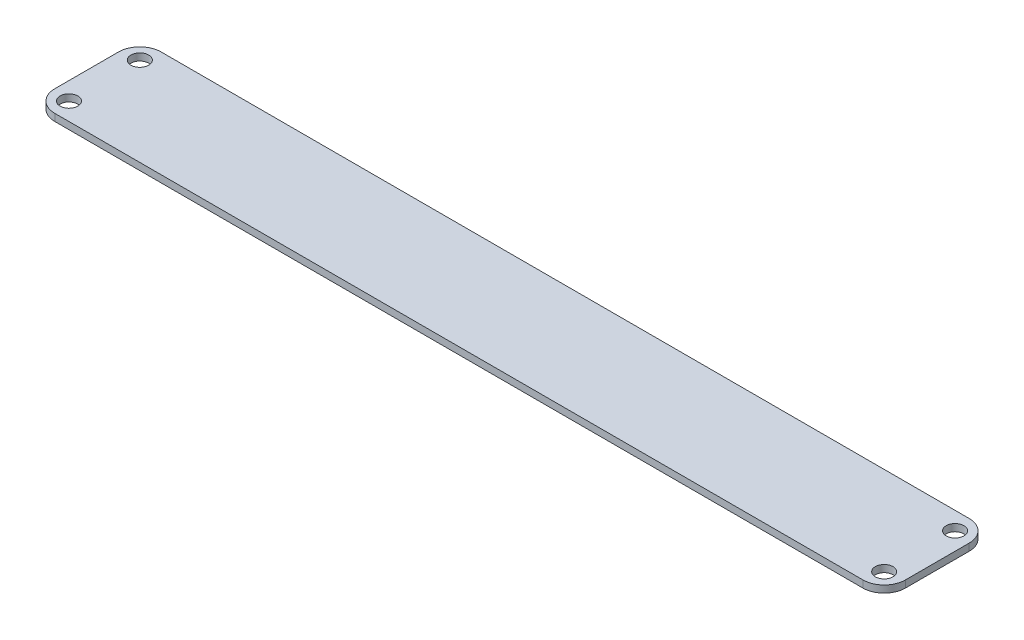
ISO-10303-21;
HEADER;
FILE_DESCRIPTION(('STEP AP214'),'2;1');
FILE_NAME('part.step','',(''),(''),'','','');
FILE_SCHEMA(('AUTOMOTIVE_DESIGN { 1 0 10303 214 1 1 1 1 }'));
ENDSEC;
DATA;
#1=APPLICATION_CONTEXT('core data for automotive mechanical design processes');
#2=APPLICATION_PROTOCOL_DEFINITION('international standard','automotive_design',2000,#1);
#3=PRODUCT_CONTEXT('',#1,'mechanical');
#4=PRODUCT('Part','Part','',(#3));
#5=PRODUCT_RELATED_PRODUCT_CATEGORY('part','',(#4));
#6=PRODUCT_DEFINITION_FORMATION('','',#4);
#7=PRODUCT_DEFINITION_CONTEXT('part definition',#1,'design');
#8=PRODUCT_DEFINITION('design','',#6,#7);
#9=PRODUCT_DEFINITION_SHAPE('','',#8);
#10=(LENGTH_UNIT() NAMED_UNIT(*) SI_UNIT(.MILLI.,.METRE.));
#11=(NAMED_UNIT(*) PLANE_ANGLE_UNIT() SI_UNIT($,.RADIAN.));
#12=(NAMED_UNIT(*) SI_UNIT($,.STERADIAN.) SOLID_ANGLE_UNIT());
#13=UNCERTAINTY_MEASURE_WITH_UNIT(LENGTH_MEASURE(1.E-05),#10,'distance_accuracy_value','');
#14=(GEOMETRIC_REPRESENTATION_CONTEXT(3) GLOBAL_UNCERTAINTY_ASSIGNED_CONTEXT((#13)) GLOBAL_UNIT_ASSIGNED_CONTEXT((#10,
#11,#12)) REPRESENTATION_CONTEXT('',''));
#15=CARTESIAN_POINT('',(0.,0.,0.));
#16=DIRECTION('',(0.,0.,1.));
#17=DIRECTION('',(1.,0.,0.));
#18=AXIS2_PLACEMENT_3D('',#15,#16,#17);
#19=CARTESIAN_POINT('',(60.,1.,-7.5));
#20=DIRECTION('',(-1.,0.,0.));
#21=DIRECTION('',(0.,0.,1.));
#22=AXIS2_PLACEMENT_3D('',#19,#20,#21);
#23=PLANE('',#22);
#24=DIRECTION('',(0.,0.,-1.));
#25=VECTOR('',#24,1.);
#26=CARTESIAN_POINT('',(60.,0.,-7.5));
#27=LINE('',#26,#25);
#28=CARTESIAN_POINT('',(60.,0.,4.5));
#29=VERTEX_POINT('',#28);
#30=CARTESIAN_POINT('',(60.,0.,-4.5));
#31=VERTEX_POINT('',#30);
#32=EDGE_CURVE('E143',#29,#31,#27,.T.);
#33=ORIENTED_EDGE('',*,*,#32,.T.);
#34=DIRECTION('',(0.,-1.,0.));
#35=VECTOR('',#34,1.);
#36=CARTESIAN_POINT('',(60.,1.,-4.5));
#37=LINE('',#36,#35);
#38=CARTESIAN_POINT('',(60.,1.,-4.5));
#39=VERTEX_POINT('',#38);
#40=EDGE_CURVE('E11',#31,#39,#37,.F.);
#41=ORIENTED_EDGE('',*,*,#40,.T.);
#42=DIRECTION('',(0.,0.,-1.));
#43=VECTOR('',#42,1.);
#44=CARTESIAN_POINT('',(60.,1.,-7.5));
#45=LINE('',#44,#43);
#46=CARTESIAN_POINT('',(60.,1.,4.5));
#47=VERTEX_POINT('',#46);
#48=EDGE_CURVE('E141',#47,#39,#45,.T.);
#49=ORIENTED_EDGE('',*,*,#48,.F.);
#50=DIRECTION('',(0.,-1.,0.));
#51=VECTOR('',#50,1.);
#52=CARTESIAN_POINT('',(60.,1.,4.5));
#53=LINE('',#52,#51);
#54=EDGE_CURVE('E50',#47,#29,#53,.T.);
#55=ORIENTED_EDGE('',*,*,#54,.T.);
#56=EDGE_LOOP('',(#33,#41,#49,#55));
#57=FACE_BOUND('',#56,.T.);
#58=ADVANCED_FACE('F41',(#57),#23,.F.);
#59=CARTESIAN_POINT('',(-60.,1.,-7.5));
#60=DIRECTION('',(0.,0.,1.));
#61=DIRECTION('',(1.,0.,0.));
#62=AXIS2_PLACEMENT_3D('',#59,#60,#61);
#63=PLANE('',#62);
#64=DIRECTION('',(-1.,0.,0.));
#65=VECTOR('',#64,1.);
#66=CARTESIAN_POINT('',(-60.,0.,-7.5));
#67=LINE('',#66,#65);
#68=CARTESIAN_POINT('',(57.,0.,-7.5));
#69=VERTEX_POINT('',#68);
#70=CARTESIAN_POINT('',(-57.,0.,-7.5));
#71=VERTEX_POINT('',#70);
#72=EDGE_CURVE('E137',#69,#71,#67,.T.);
#73=ORIENTED_EDGE('',*,*,#72,.T.);
#74=DIRECTION('',(0.,-1.,0.));
#75=VECTOR('',#74,1.);
#76=CARTESIAN_POINT('',(-57.,1.,-7.5));
#77=LINE('',#76,#75);
#78=CARTESIAN_POINT('',(-57.,1.,-7.5));
#79=VERTEX_POINT('',#78);
#80=EDGE_CURVE('E113',#71,#79,#77,.F.);
#81=ORIENTED_EDGE('',*,*,#80,.T.);
#82=DIRECTION('',(-1.,0.,0.));
#83=VECTOR('',#82,1.);
#84=CARTESIAN_POINT('',(-60.,1.,-7.5));
#85=LINE('',#84,#83);
#86=CARTESIAN_POINT('',(57.,1.,-7.5));
#87=VERTEX_POINT('',#86);
#88=EDGE_CURVE('E200',#87,#79,#85,.T.);
#89=ORIENTED_EDGE('',*,*,#88,.F.);
#90=DIRECTION('',(0.,-1.,0.));
#91=VECTOR('',#90,1.);
#92=CARTESIAN_POINT('',(57.,1.,-7.5));
#93=LINE('',#92,#91);
#94=EDGE_CURVE('E119',#87,#69,#93,.T.);
#95=ORIENTED_EDGE('',*,*,#94,.T.);
#96=EDGE_LOOP('',(#73,#81,#89,#95));
#97=FACE_BOUND('',#96,.T.);
#98=ADVANCED_FACE('F267',(#97),#63,.F.);
#99=CARTESIAN_POINT('',(-60.,1.,-7.5));
#100=DIRECTION('',(1.,0.,0.));
#101=DIRECTION('',(0.,0.,-1.));
#102=AXIS2_PLACEMENT_3D('',#99,#100,#101);
#103=PLANE('',#102);
#104=DIRECTION('',(0.,0.,1.));
#105=VECTOR('',#104,1.);
#106=CARTESIAN_POINT('',(-60.,1.,-7.5));
#107=LINE('',#106,#105);
#108=CARTESIAN_POINT('',(-60.,1.,-4.5));
#109=VERTEX_POINT('',#108);
#110=CARTESIAN_POINT('',(-60.,1.,4.5));
#111=VERTEX_POINT('',#110);
#112=EDGE_CURVE('E128',#109,#111,#107,.T.);
#113=ORIENTED_EDGE('',*,*,#112,.F.);
#114=DIRECTION('',(0.,-1.,0.));
#115=VECTOR('',#114,1.);
#116=CARTESIAN_POINT('',(-60.,1.,-4.5));
#117=LINE('',#116,#115);
#118=CARTESIAN_POINT('',(-60.,0.,-4.5));
#119=VERTEX_POINT('',#118);
#120=EDGE_CURVE('E112',#109,#119,#117,.T.);
#121=ORIENTED_EDGE('',*,*,#120,.T.);
#122=DIRECTION('',(0.,0.,1.));
#123=VECTOR('',#122,1.);
#124=CARTESIAN_POINT('',(-60.,0.,-7.5));
#125=LINE('',#124,#123);
#126=CARTESIAN_POINT('',(-60.,0.,4.5));
#127=VERTEX_POINT('',#126);
#128=EDGE_CURVE('E126',#119,#127,#125,.T.);
#129=ORIENTED_EDGE('',*,*,#128,.T.);
#130=DIRECTION('',(0.,-1.,0.));
#131=VECTOR('',#130,1.);
#132=CARTESIAN_POINT('',(-60.,1.,4.5));
#133=LINE('',#132,#131);
#134=EDGE_CURVE('E131',#127,#111,#133,.F.);
#135=ORIENTED_EDGE('',*,*,#134,.T.);
#136=EDGE_LOOP('',(#113,#121,#129,#135));
#137=FACE_BOUND('',#136,.T.);
#138=ADVANCED_FACE('F125',(#137),#103,.F.);
#139=CARTESIAN_POINT('',(-60.,1.,7.5));
#140=DIRECTION('',(0.,0.,-1.));
#141=DIRECTION('',(-1.,0.,0.));
#142=AXIS2_PLACEMENT_3D('',#139,#140,#141);
#143=PLANE('',#142);
#144=DIRECTION('',(1.,0.,0.));
#145=VECTOR('',#144,1.);
#146=CARTESIAN_POINT('',(-60.,1.,7.5));
#147=LINE('',#146,#145);
#148=CARTESIAN_POINT('',(-57.,1.,7.5));
#149=VERTEX_POINT('',#148);
#150=CARTESIAN_POINT('',(57.,1.,7.5));
#151=VERTEX_POINT('',#150);
#152=EDGE_CURVE('E148',#149,#151,#147,.T.);
#153=ORIENTED_EDGE('',*,*,#152,.F.);
#154=DIRECTION('',(0.,-1.,0.));
#155=VECTOR('',#154,1.);
#156=CARTESIAN_POINT('',(-57.,1.,7.5));
#157=LINE('',#156,#155);
#158=CARTESIAN_POINT('',(-57.,0.,7.5));
#159=VERTEX_POINT('',#158);
#160=EDGE_CURVE('E175',#149,#159,#157,.T.);
#161=ORIENTED_EDGE('',*,*,#160,.T.);
#162=DIRECTION('',(1.,0.,0.));
#163=VECTOR('',#162,1.);
#164=CARTESIAN_POINT('',(-60.,0.,7.5));
#165=LINE('',#164,#163);
#166=CARTESIAN_POINT('',(57.,0.,7.5));
#167=VERTEX_POINT('',#166);
#168=EDGE_CURVE('E136',#159,#167,#165,.T.);
#169=ORIENTED_EDGE('',*,*,#168,.T.);
#170=DIRECTION('',(0.,-1.,0.));
#171=VECTOR('',#170,1.);
#172=CARTESIAN_POINT('',(57.,1.,7.5));
#173=LINE('',#172,#171);
#174=EDGE_CURVE('E57',#167,#151,#173,.F.);
#175=ORIENTED_EDGE('',*,*,#174,.T.);
#176=EDGE_LOOP('',(#153,#161,#169,#175));
#177=FACE_BOUND('',#176,.T.);
#178=ADVANCED_FACE('F289',(#177),#143,.F.);
#179=CARTESIAN_POINT('',(0.,1.,0.));
#180=DIRECTION('',(0.,1.,0.));
#181=DIRECTION('',(0.,0.,1.));
#182=AXIS2_PLACEMENT_3D('',#179,#180,#181);
#183=PLANE('',#182);
#184=CARTESIAN_POINT('',(57.5,1.,-5.));
#185=DIRECTION('',(0.,-1.,0.));
#186=DIRECTION('',(0.,0.,1.));
#187=AXIS2_PLACEMENT_3D('',#184,#185,#186);
#188=CIRCLE('',#187,1.25);
#189=CARTESIAN_POINT('',(57.5,1.,-3.75));
#190=VERTEX_POINT('',#189);
#191=EDGE_CURVE('E225',#190,#190,#188,.T.);
#192=ORIENTED_EDGE('',*,*,#191,.T.);
#193=EDGE_LOOP('',(#192));
#194=FACE_BOUND('',#193,.T.);
#195=CARTESIAN_POINT('',(57.5,1.,5.));
#196=DIRECTION('',(0.,1.,0.));
#197=DIRECTION('',(0.,0.,-1.));
#198=AXIS2_PLACEMENT_3D('',#195,#196,#197);
#199=CIRCLE('',#198,1.25);
#200=CARTESIAN_POINT('',(57.5,1.,3.75));
#201=VERTEX_POINT('',#200);
#202=EDGE_CURVE('E221',#201,#201,#199,.T.);
#203=ORIENTED_EDGE('',*,*,#202,.F.);
#204=EDGE_LOOP('',(#203));
#205=FACE_BOUND('',#204,.T.);
#206=CARTESIAN_POINT('',(-57.5,1.,5.));
#207=DIRECTION('',(0.,-1.,0.));
#208=DIRECTION('',(0.,0.,-1.));
#209=AXIS2_PLACEMENT_3D('',#206,#207,#208);
#210=CIRCLE('',#209,1.25);
#211=CARTESIAN_POINT('',(-57.5,1.,3.75));
#212=VERTEX_POINT('',#211);
#213=EDGE_CURVE('E209',#212,#212,#210,.T.);
#214=ORIENTED_EDGE('',*,*,#213,.T.);
#215=EDGE_LOOP('',(#214));
#216=FACE_BOUND('',#215,.T.);
#217=CARTESIAN_POINT('',(-57.5,1.,-5.));
#218=DIRECTION('',(0.,1.,0.));
#219=DIRECTION('',(0.,0.,1.));
#220=AXIS2_PLACEMENT_3D('',#217,#218,#219);
#221=CIRCLE('',#220,1.25);
#222=CARTESIAN_POINT('',(-57.5,1.,-3.75));
#223=VERTEX_POINT('',#222);
#224=EDGE_CURVE('E193',#223,#223,#221,.T.);
#225=ORIENTED_EDGE('',*,*,#224,.F.);
#226=EDGE_LOOP('',(#225));
#227=FACE_BOUND('',#226,.T.);
#228=ORIENTED_EDGE('',*,*,#88,.T.);
#229=CARTESIAN_POINT('',(-57.,1.,-4.5));
#230=DIRECTION('',(0.,1.,0.));
#231=DIRECTION('',(0.,0.,1.));
#232=AXIS2_PLACEMENT_3D('',#229,#230,#231);
#233=CIRCLE('',#232,3.);
#234=EDGE_CURVE('E170',#79,#109,#233,.T.);
#235=ORIENTED_EDGE('',*,*,#234,.T.);
#236=ORIENTED_EDGE('',*,*,#112,.T.);
#237=CARTESIAN_POINT('',(-57.,1.,4.5));
#238=DIRECTION('',(0.,1.,0.));
#239=DIRECTION('',(0.,0.,1.));
#240=AXIS2_PLACEMENT_3D('',#237,#238,#239);
#241=CIRCLE('',#240,3.);
#242=EDGE_CURVE('E64',#111,#149,#241,.T.);
#243=ORIENTED_EDGE('',*,*,#242,.T.);
#244=ORIENTED_EDGE('',*,*,#152,.T.);
#245=CARTESIAN_POINT('',(57.,1.,4.5));
#246=DIRECTION('',(0.,1.,0.));
#247=DIRECTION('',(0.,0.,1.));
#248=AXIS2_PLACEMENT_3D('',#245,#246,#247);
#249=CIRCLE('',#248,3.);
#250=EDGE_CURVE('E162',#151,#47,#249,.T.);
#251=ORIENTED_EDGE('',*,*,#250,.T.);
#252=ORIENTED_EDGE('',*,*,#48,.T.);
#253=CARTESIAN_POINT('',(57.,1.,-4.5));
#254=DIRECTION('',(0.,1.,0.));
#255=DIRECTION('',(0.,0.,1.));
#256=AXIS2_PLACEMENT_3D('',#253,#254,#255);
#257=CIRCLE('',#256,3.);
#258=EDGE_CURVE('E165',#39,#87,#257,.T.);
#259=ORIENTED_EDGE('',*,*,#258,.T.);
#260=EDGE_LOOP('',(#228,#235,#236,#243,#244,#251,#252,#259));
#261=FACE_BOUND('',#260,.T.);
#262=ADVANCED_FACE('F234',(#194,#205,#216,#227,#261),#183,.T.);
#263=CARTESIAN_POINT('',(0.,0.,0.));
#264=DIRECTION('',(0.,1.,0.));
#265=DIRECTION('',(0.,0.,1.));
#266=AXIS2_PLACEMENT_3D('',#263,#264,#265);
#267=PLANE('',#266);
#268=CARTESIAN_POINT('',(57.5,0.,-5.));
#269=DIRECTION('',(0.,1.,0.));
#270=DIRECTION('',(0.,0.,1.));
#271=AXIS2_PLACEMENT_3D('',#268,#269,#270);
#272=CIRCLE('',#271,1.25);
#273=CARTESIAN_POINT('',(57.5,0.,-3.75));
#274=VERTEX_POINT('',#273);
#275=EDGE_CURVE('E226',#274,#274,#272,.T.);
#276=ORIENTED_EDGE('',*,*,#275,.T.);
#277=EDGE_LOOP('',(#276));
#278=FACE_BOUND('',#277,.T.);
#279=CARTESIAN_POINT('',(57.5,0.,5.));
#280=DIRECTION('',(0.,1.,0.));
#281=DIRECTION('',(0.,0.,1.));
#282=AXIS2_PLACEMENT_3D('',#279,#280,#281);
#283=CIRCLE('',#282,1.25);
#284=CARTESIAN_POINT('',(57.5,0.,6.25));
#285=VERTEX_POINT('',#284);
#286=EDGE_CURVE('E214',#285,#285,#283,.F.);
#287=ORIENTED_EDGE('',*,*,#286,.F.);
#288=EDGE_LOOP('',(#287));
#289=FACE_BOUND('',#288,.T.);
#290=CARTESIAN_POINT('',(-57.5,0.,5.));
#291=DIRECTION('',(0.,1.,0.));
#292=DIRECTION('',(0.,0.,1.));
#293=AXIS2_PLACEMENT_3D('',#290,#291,#292);
#294=CIRCLE('',#293,1.25);
#295=CARTESIAN_POINT('',(-57.5,0.,6.25));
#296=VERTEX_POINT('',#295);
#297=EDGE_CURVE('E210',#296,#296,#294,.T.);
#298=ORIENTED_EDGE('',*,*,#297,.T.);
#299=EDGE_LOOP('',(#298));
#300=FACE_BOUND('',#299,.T.);
#301=CARTESIAN_POINT('',(-57.5,0.,-5.));
#302=DIRECTION('',(0.,1.,0.));
#303=DIRECTION('',(0.,0.,1.));
#304=AXIS2_PLACEMENT_3D('',#301,#302,#303);
#305=CIRCLE('',#304,1.25);
#306=CARTESIAN_POINT('',(-57.5,0.,-3.75));
#307=VERTEX_POINT('',#306);
#308=EDGE_CURVE('E190',#307,#307,#305,.F.);
#309=ORIENTED_EDGE('',*,*,#308,.F.);
#310=EDGE_LOOP('',(#309));
#311=FACE_BOUND('',#310,.T.);
#312=ORIENTED_EDGE('',*,*,#128,.F.);
#313=CARTESIAN_POINT('',(-57.,0.,-4.5));
#314=DIRECTION('',(0.,1.,0.));
#315=DIRECTION('',(0.,0.,1.));
#316=AXIS2_PLACEMENT_3D('',#313,#314,#315);
#317=CIRCLE('',#316,3.);
#318=EDGE_CURVE('E108',#119,#71,#317,.F.);
#319=ORIENTED_EDGE('',*,*,#318,.T.);
#320=ORIENTED_EDGE('',*,*,#72,.F.);
#321=CARTESIAN_POINT('',(57.,0.,-4.5));
#322=DIRECTION('',(0.,1.,0.));
#323=DIRECTION('',(0.,0.,1.));
#324=AXIS2_PLACEMENT_3D('',#321,#322,#323);
#325=CIRCLE('',#324,3.);
#326=EDGE_CURVE('E152',#69,#31,#325,.F.);
#327=ORIENTED_EDGE('',*,*,#326,.T.);
#328=ORIENTED_EDGE('',*,*,#32,.F.);
#329=CARTESIAN_POINT('',(57.,0.,4.5));
#330=DIRECTION('',(0.,1.,0.));
#331=DIRECTION('',(0.,0.,1.));
#332=AXIS2_PLACEMENT_3D('',#329,#330,#331);
#333=CIRCLE('',#332,3.);
#334=EDGE_CURVE('E130',#29,#167,#333,.F.);
#335=ORIENTED_EDGE('',*,*,#334,.T.);
#336=ORIENTED_EDGE('',*,*,#168,.F.);
#337=CARTESIAN_POINT('',(-57.,0.,4.5));
#338=DIRECTION('',(0.,1.,0.));
#339=DIRECTION('',(0.,0.,1.));
#340=AXIS2_PLACEMENT_3D('',#337,#338,#339);
#341=CIRCLE('',#340,3.);
#342=EDGE_CURVE('E120',#159,#127,#341,.F.);
#343=ORIENTED_EDGE('',*,*,#342,.T.);
#344=EDGE_LOOP('',(#312,#319,#320,#327,#328,#335,#336,#343));
#345=FACE_BOUND('',#344,.T.);
#346=ADVANCED_FACE('F133',(#278,#289,#300,#311,#345),#267,.F.);
#347=CARTESIAN_POINT('',(-57.,1.,-4.5));
#348=DIRECTION('',(0.,-1.,0.));
#349=DIRECTION('',(0.,0.,-1.));
#350=AXIS2_PLACEMENT_3D('',#347,#348,#349);
#351=CYLINDRICAL_SURFACE('',#350,3.);
#352=ORIENTED_EDGE('',*,*,#234,.F.);
#353=ORIENTED_EDGE('',*,*,#80,.F.);
#354=ORIENTED_EDGE('',*,*,#318,.F.);
#355=ORIENTED_EDGE('',*,*,#120,.F.);
#356=EDGE_LOOP('',(#352,#353,#354,#355));
#357=FACE_BOUND('',#356,.T.);
#358=ADVANCED_FACE('F111',(#357),#351,.T.);
#359=CARTESIAN_POINT('',(-57.,1.,4.5));
#360=DIRECTION('',(0.,-1.,0.));
#361=DIRECTION('',(0.,0.,-1.));
#362=AXIS2_PLACEMENT_3D('',#359,#360,#361);
#363=CYLINDRICAL_SURFACE('',#362,3.);
#364=ORIENTED_EDGE('',*,*,#242,.F.);
#365=ORIENTED_EDGE('',*,*,#134,.F.);
#366=ORIENTED_EDGE('',*,*,#342,.F.);
#367=ORIENTED_EDGE('',*,*,#160,.F.);
#368=EDGE_LOOP('',(#364,#365,#366,#367));
#369=FACE_BOUND('',#368,.T.);
#370=ADVANCED_FACE('F278',(#369),#363,.T.);
#371=CARTESIAN_POINT('',(57.,1.,-4.5));
#372=DIRECTION('',(0.,-1.,0.));
#373=DIRECTION('',(0.,0.,-1.));
#374=AXIS2_PLACEMENT_3D('',#371,#372,#373);
#375=CYLINDRICAL_SURFACE('',#374,3.);
#376=ORIENTED_EDGE('',*,*,#258,.F.);
#377=ORIENTED_EDGE('',*,*,#40,.F.);
#378=ORIENTED_EDGE('',*,*,#326,.F.);
#379=ORIENTED_EDGE('',*,*,#94,.F.);
#380=EDGE_LOOP('',(#376,#377,#378,#379));
#381=FACE_BOUND('',#380,.T.);
#382=ADVANCED_FACE('F264',(#381),#375,.T.);
#383=CARTESIAN_POINT('',(57.,1.,4.5));
#384=DIRECTION('',(0.,-1.,0.));
#385=DIRECTION('',(0.,0.,-1.));
#386=AXIS2_PLACEMENT_3D('',#383,#384,#385);
#387=CYLINDRICAL_SURFACE('',#386,3.);
#388=ORIENTED_EDGE('',*,*,#250,.F.);
#389=ORIENTED_EDGE('',*,*,#174,.F.);
#390=ORIENTED_EDGE('',*,*,#334,.F.);
#391=ORIENTED_EDGE('',*,*,#54,.F.);
#392=EDGE_LOOP('',(#388,#389,#390,#391));
#393=FACE_BOUND('',#392,.T.);
#394=ADVANCED_FACE('F43',(#393),#387,.T.);
#395=CARTESIAN_POINT('',(-57.5,-0.000999999999999916,-5.));
#396=DIRECTION('',(0.,1.,0.));
#397=DIRECTION('',(0.,0.,1.));
#398=AXIS2_PLACEMENT_3D('',#395,#396,#397);
#399=CYLINDRICAL_SURFACE('',#398,1.25);
#400=ORIENTED_EDGE('',*,*,#224,.T.);
#401=EDGE_LOOP('',(#400));
#402=FACE_BOUND('',#401,.T.);
#403=ORIENTED_EDGE('',*,*,#308,.T.);
#404=EDGE_LOOP('',(#403));
#405=FACE_BOUND('',#404,.T.);
#406=ADVANCED_FACE('F253',(#402,#405),#399,.F.);
#407=CARTESIAN_POINT('',(-57.5,-0.000999999999999916,5.));
#408=DIRECTION('',(0.,1.,0.));
#409=DIRECTION('',(0.,0.,1.));
#410=AXIS2_PLACEMENT_3D('',#407,#408,#409);
#411=CYLINDRICAL_SURFACE('',#410,1.25);
#412=ORIENTED_EDGE('',*,*,#213,.F.);
#413=EDGE_LOOP('',(#412));
#414=FACE_BOUND('',#413,.T.);
#415=ORIENTED_EDGE('',*,*,#297,.F.);
#416=EDGE_LOOP('',(#415));
#417=FACE_BOUND('',#416,.T.);
#418=ADVANCED_FACE('F255',(#414,#417),#411,.F.);
#419=CARTESIAN_POINT('',(57.5,-0.000999999999999916,5.));
#420=DIRECTION('',(0.,1.,0.));
#421=DIRECTION('',(0.,0.,1.));
#422=AXIS2_PLACEMENT_3D('',#419,#420,#421);
#423=CYLINDRICAL_SURFACE('',#422,1.25);
#424=ORIENTED_EDGE('',*,*,#202,.T.);
#425=EDGE_LOOP('',(#424));
#426=FACE_BOUND('',#425,.T.);
#427=ORIENTED_EDGE('',*,*,#286,.T.);
#428=EDGE_LOOP('',(#427));
#429=FACE_BOUND('',#428,.T.);
#430=ADVANCED_FACE('F240',(#426,#429),#423,.F.);
#431=CARTESIAN_POINT('',(57.5,-0.000999999999999916,-5.));
#432=DIRECTION('',(0.,1.,0.));
#433=DIRECTION('',(0.,0.,1.));
#434=AXIS2_PLACEMENT_3D('',#431,#432,#433);
#435=CYLINDRICAL_SURFACE('',#434,1.25);
#436=ORIENTED_EDGE('',*,*,#191,.F.);
#437=EDGE_LOOP('',(#436));
#438=FACE_BOUND('',#437,.T.);
#439=ORIENTED_EDGE('',*,*,#275,.F.);
#440=EDGE_LOOP('',(#439));
#441=FACE_BOUND('',#440,.T.);
#442=ADVANCED_FACE('F237',(#438,#441),#435,.F.);
#443=CLOSED_SHELL('',(#58,#98,#138,#178,#262,#346,#358,#370,#382,#394,#406,#418,#430,#442));
#444=MANIFOLD_SOLID_BREP('B2',#443);
#445=ADVANCED_BREP_SHAPE_REPRESENTATION('',(#18,#444),#14);
#446=SHAPE_DEFINITION_REPRESENTATION(#9,#445);
ENDSEC;
END-ISO-10303-21;
